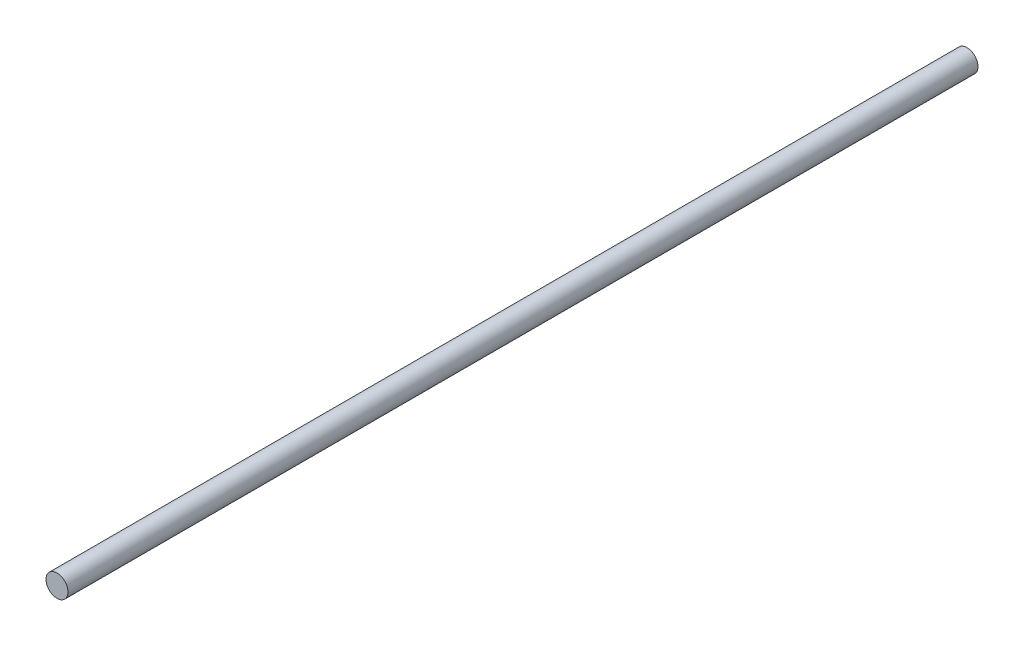
ISO-10303-21;
HEADER;
FILE_DESCRIPTION(('STEP AP214'),'2;1');
FILE_NAME('part.step','',(''),(''),'','','');
FILE_SCHEMA(('AUTOMOTIVE_DESIGN { 1 0 10303 214 1 1 1 1 }'));
ENDSEC;
DATA;
#1=APPLICATION_CONTEXT('core data for automotive mechanical design processes');
#2=APPLICATION_PROTOCOL_DEFINITION('international standard','automotive_design',2000,#1);
#3=PRODUCT_CONTEXT('',#1,'mechanical');
#4=PRODUCT('Part','Part','',(#3));
#5=PRODUCT_RELATED_PRODUCT_CATEGORY('part','',(#4));
#6=PRODUCT_DEFINITION_FORMATION('','',#4);
#7=PRODUCT_DEFINITION_CONTEXT('part definition',#1,'design');
#8=PRODUCT_DEFINITION('design','',#6,#7);
#9=PRODUCT_DEFINITION_SHAPE('','',#8);
#10=(LENGTH_UNIT() NAMED_UNIT(*) SI_UNIT(.MILLI.,.METRE.));
#11=(NAMED_UNIT(*) PLANE_ANGLE_UNIT() SI_UNIT($,.RADIAN.));
#12=(NAMED_UNIT(*) SI_UNIT($,.STERADIAN.) SOLID_ANGLE_UNIT());
#13=UNCERTAINTY_MEASURE_WITH_UNIT(LENGTH_MEASURE(1.E-05),#10,'distance_accuracy_value','');
#14=(GEOMETRIC_REPRESENTATION_CONTEXT(3) GLOBAL_UNCERTAINTY_ASSIGNED_CONTEXT((#13)) GLOBAL_UNIT_ASSIGNED_CONTEXT((#10,
#11,#12)) REPRESENTATION_CONTEXT('',''));
#15=CARTESIAN_POINT('',(0.,0.,0.));
#16=DIRECTION('',(0.,0.,1.));
#17=DIRECTION('',(1.,0.,0.));
#18=AXIS2_PLACEMENT_3D('',#15,#16,#17);
#19=CARTESIAN_POINT('',(0.,0.,62.));
#20=DIRECTION('',(0.,0.,-1.));
#21=DIRECTION('',(-1.,0.,0.));
#22=AXIS2_PLACEMENT_3D('',#19,#20,#21);
#23=CYLINDRICAL_SURFACE('',#22,0.75);
#24=CARTESIAN_POINT('',(0.,0.,62.));
#25=DIRECTION('',(0.,0.,1.));
#26=DIRECTION('',(1.,0.,0.));
#27=AXIS2_PLACEMENT_3D('',#24,#25,#26);
#28=CIRCLE('',#27,0.75);
#29=CARTESIAN_POINT('',(0.75,0.,62.));
#30=VERTEX_POINT('',#29);
#31=EDGE_CURVE('E10',#30,#30,#28,.T.);
#32=ORIENTED_EDGE('',*,*,#31,.F.);
#33=EDGE_LOOP('',(#32));
#34=FACE_BOUND('',#33,.T.);
#35=CARTESIAN_POINT('',(0.,0.,0.));
#36=DIRECTION('',(0.,0.,1.));
#37=DIRECTION('',(1.,0.,0.));
#38=AXIS2_PLACEMENT_3D('',#35,#36,#37);
#39=CIRCLE('',#38,0.75);
#40=CARTESIAN_POINT('',(0.75,0.,0.));
#41=VERTEX_POINT('',#40);
#42=EDGE_CURVE('E37',#41,#41,#39,.T.);
#43=ORIENTED_EDGE('',*,*,#42,.T.);
#44=EDGE_LOOP('',(#43));
#45=FACE_BOUND('',#44,.T.);
#46=ADVANCED_FACE('F34',(#34,#45),#23,.T.);
#47=CARTESIAN_POINT('',(0.,0.,62.));
#48=DIRECTION('',(0.,0.,1.));
#49=DIRECTION('',(1.,0.,0.));
#50=AXIS2_PLACEMENT_3D('',#47,#48,#49);
#51=PLANE('',#50);
#52=ORIENTED_EDGE('',*,*,#31,.T.);
#53=EDGE_LOOP('',(#52));
#54=FACE_BOUND('',#53,.T.);
#55=ADVANCED_FACE('F53',(#54),#51,.T.);
#56=CARTESIAN_POINT('',(0.,0.,0.));
#57=DIRECTION('',(0.,0.,1.));
#58=DIRECTION('',(1.,0.,0.));
#59=AXIS2_PLACEMENT_3D('',#56,#57,#58);
#60=PLANE('',#59);
#61=ORIENTED_EDGE('',*,*,#42,.F.);
#62=EDGE_LOOP('',(#61));
#63=FACE_BOUND('',#62,.T.);
#64=ADVANCED_FACE('F51',(#63),#60,.F.);
#65=CLOSED_SHELL('',(#46,#55,#64));
#66=MANIFOLD_SOLID_BREP('B2',#65);
#67=ADVANCED_BREP_SHAPE_REPRESENTATION('',(#18,#66),#14);
#68=SHAPE_DEFINITION_REPRESENTATION(#9,#67);
ENDSEC;
END-ISO-10303-21;
